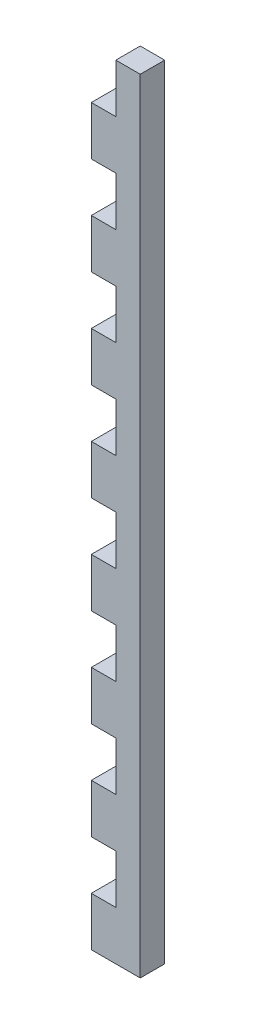
ISO-10303-21;
HEADER;
FILE_DESCRIPTION(('STEP AP214'),'2;1');
FILE_NAME('part.step','',(''),(''),'','','');
FILE_SCHEMA(('AUTOMOTIVE_DESIGN { 1 0 10303 214 1 1 1 1 }'));
ENDSEC;
DATA;
#1=APPLICATION_CONTEXT('core data for automotive mechanical design processes');
#2=APPLICATION_PROTOCOL_DEFINITION('international standard','automotive_design',2000,#1);
#3=PRODUCT_CONTEXT('',#1,'mechanical');
#4=PRODUCT('Part','Part','',(#3));
#5=PRODUCT_RELATED_PRODUCT_CATEGORY('part','',(#4));
#6=PRODUCT_DEFINITION_FORMATION('','',#4);
#7=PRODUCT_DEFINITION_CONTEXT('part definition',#1,'design');
#8=PRODUCT_DEFINITION('design','',#6,#7);
#9=PRODUCT_DEFINITION_SHAPE('','',#8);
#10=(LENGTH_UNIT() NAMED_UNIT(*) SI_UNIT(.MILLI.,.METRE.));
#11=(NAMED_UNIT(*) PLANE_ANGLE_UNIT() SI_UNIT($,.RADIAN.));
#12=(NAMED_UNIT(*) SI_UNIT($,.STERADIAN.) SOLID_ANGLE_UNIT());
#13=UNCERTAINTY_MEASURE_WITH_UNIT(LENGTH_MEASURE(1.E-05),#10,'distance_accuracy_value','');
#14=(GEOMETRIC_REPRESENTATION_CONTEXT(3) GLOBAL_UNCERTAINTY_ASSIGNED_CONTEXT((#13)) GLOBAL_UNIT_ASSIGNED_CONTEXT((#10,
#11,#12)) REPRESENTATION_CONTEXT('',''));
#15=CARTESIAN_POINT('',(0.,0.,0.));
#16=DIRECTION('',(0.,0.,1.));
#17=DIRECTION('',(1.,0.,0.));
#18=AXIS2_PLACEMENT_3D('',#15,#16,#17);
#19=CARTESIAN_POINT('',(0.,-76.8888888888889,5.));
#20=DIRECTION('',(0.,1.,0.));
#21=DIRECTION('',(0.,0.,1.));
#22=AXIS2_PLACEMENT_3D('',#19,#20,#21);
#23=PLANE('',#22);
#24=DIRECTION('',(1.,0.,0.));
#25=VECTOR('',#24,1.);
#26=CARTESIAN_POINT('',(0.,-76.8888888888889,0.));
#27=LINE('',#26,#25);
#28=CARTESIAN_POINT('',(-10.5031095495496,-76.8888888888889,0.));
#29=VERTEX_POINT('',#28);
#30=CARTESIAN_POINT('',(-5.50310954954811,-76.8888888888889,0.));
#31=VERTEX_POINT('',#30);
#32=EDGE_CURVE('E286',#29,#31,#27,.T.);
#33=ORIENTED_EDGE('',*,*,#32,.F.);
#34=DIRECTION('',(0.,0.,-1.));
#35=VECTOR('',#34,1.);
#36=CARTESIAN_POINT('',(-10.5031095495496,-76.8888888888889,5.));
#37=LINE('',#36,#35);
#38=CARTESIAN_POINT('',(-10.5031095495496,-76.8888888888889,5.));
#39=VERTEX_POINT('',#38);
#40=EDGE_CURVE('E11',#39,#29,#37,.T.);
#41=ORIENTED_EDGE('',*,*,#40,.F.);
#42=DIRECTION('',(1.,0.,0.));
#43=VECTOR('',#42,1.);
#44=CARTESIAN_POINT('',(0.,-76.8888888888889,5.));
#45=LINE('',#44,#43);
#46=CARTESIAN_POINT('',(-5.50310954954811,-76.8888888888889,5.));
#47=VERTEX_POINT('',#46);
#48=EDGE_CURVE('E363',#39,#47,#45,.T.);
#49=ORIENTED_EDGE('',*,*,#48,.T.);
#50=DIRECTION('',(0.,0.,-1.));
#51=VECTOR('',#50,1.);
#52=CARTESIAN_POINT('',(-5.50310954954811,-76.8888888888889,5.));
#53=LINE('',#52,#51);
#54=EDGE_CURVE('E164',#47,#31,#53,.T.);
#55=ORIENTED_EDGE('',*,*,#54,.T.);
#56=EDGE_LOOP('',(#33,#41,#49,#55));
#57=FACE_BOUND('',#56,.T.);
#58=ADVANCED_FACE('F35',(#57),#23,.T.);
#59=CARTESIAN_POINT('',(-10.5031095495496,0.,5.));
#60=DIRECTION('',(1.,0.,0.));
#61=DIRECTION('',(0.,1.,0.));
#62=AXIS2_PLACEMENT_3D('',#59,#60,#61);
#63=PLANE('',#62);
#64=DIRECTION('',(0.,-1.,0.));
#65=VECTOR('',#64,1.);
#66=CARTESIAN_POINT('',(-10.5031095495496,0.,0.));
#67=LINE('',#66,#65);
#68=CARTESIAN_POINT('',(-10.5031095495496,-86.8888888888889,0.));
#69=VERTEX_POINT('',#68);
#70=EDGE_CURVE('E289',#29,#69,#67,.T.);
#71=ORIENTED_EDGE('',*,*,#70,.T.);
#72=DIRECTION('',(0.,0.,-1.));
#73=VECTOR('',#72,1.);
#74=CARTESIAN_POINT('',(-10.5031095495496,-86.8888888888889,5.));
#75=LINE('',#74,#73);
#76=CARTESIAN_POINT('',(-10.5031095495496,-86.8888888888889,5.));
#77=VERTEX_POINT('',#76);
#78=EDGE_CURVE('E43',#77,#69,#75,.T.);
#79=ORIENTED_EDGE('',*,*,#78,.F.);
#80=DIRECTION('',(0.,-1.,0.));
#81=VECTOR('',#80,1.);
#82=CARTESIAN_POINT('',(-10.5031095495496,0.,5.));
#83=LINE('',#82,#81);
#84=EDGE_CURVE('E272',#39,#77,#83,.T.);
#85=ORIENTED_EDGE('',*,*,#84,.F.);
#86=ORIENTED_EDGE('',*,*,#40,.T.);
#87=EDGE_LOOP('',(#71,#79,#85,#86));
#88=FACE_BOUND('',#87,.T.);
#89=ADVANCED_FACE('F635',(#88),#63,.F.);
#90=CARTESIAN_POINT('',(0.,-86.8888888888889,5.));
#91=DIRECTION('',(0.,1.,0.));
#92=DIRECTION('',(0.,0.,1.));
#93=AXIS2_PLACEMENT_3D('',#90,#91,#92);
#94=PLANE('',#93);
#95=DIRECTION('',(1.,0.,0.));
#96=VECTOR('',#95,1.);
#97=CARTESIAN_POINT('',(0.,-86.8888888888889,0.));
#98=LINE('',#97,#96);
#99=CARTESIAN_POINT('',(-0.50310954954956,-86.8888888888889,0.));
#100=VERTEX_POINT('',#99);
#101=EDGE_CURVE('E291',#69,#100,#98,.T.);
#102=ORIENTED_EDGE('',*,*,#101,.T.);
#103=DIRECTION('',(0.,0.,-1.));
#104=VECTOR('',#103,1.);
#105=CARTESIAN_POINT('',(-0.50310954954956,-86.8888888888889,5.));
#106=LINE('',#105,#104);
#107=CARTESIAN_POINT('',(-0.50310954954956,-86.8888888888889,5.));
#108=VERTEX_POINT('',#107);
#109=EDGE_CURVE('E433',#108,#100,#106,.T.);
#110=ORIENTED_EDGE('',*,*,#109,.F.);
#111=DIRECTION('',(1.,0.,0.));
#112=VECTOR('',#111,1.);
#113=CARTESIAN_POINT('',(0.,-86.8888888888889,5.));
#114=LINE('',#113,#112);
#115=EDGE_CURVE('E441',#77,#108,#114,.T.);
#116=ORIENTED_EDGE('',*,*,#115,.F.);
#117=ORIENTED_EDGE('',*,*,#78,.T.);
#118=EDGE_LOOP('',(#102,#110,#116,#117));
#119=FACE_BOUND('',#118,.T.);
#120=ADVANCED_FACE('F439',(#119),#94,.F.);
#121=CARTESIAN_POINT('',(-0.50310954954957,0.,5.));
#122=DIRECTION('',(1.,0.,0.));
#123=DIRECTION('',(0.,1.,0.));
#124=AXIS2_PLACEMENT_3D('',#121,#122,#123);
#125=PLANE('',#124);
#126=DIRECTION('',(0.,-1.,0.));
#127=VECTOR('',#126,1.);
#128=CARTESIAN_POINT('',(-0.50310954954957,0.,0.));
#129=LINE('',#128,#127);
#130=CARTESIAN_POINT('',(-0.503109549549579,73.1111111111111,0.));
#131=VERTEX_POINT('',#130);
#132=EDGE_CURVE('E295',#131,#100,#129,.T.);
#133=ORIENTED_EDGE('',*,*,#132,.F.);
#134=DIRECTION('',(0.,0.,-1.));
#135=VECTOR('',#134,1.);
#136=CARTESIAN_POINT('',(-0.503109549549579,73.1111111111111,5.));
#137=LINE('',#136,#135);
#138=CARTESIAN_POINT('',(-0.503109549549579,73.1111111111111,5.));
#139=VERTEX_POINT('',#138);
#140=EDGE_CURVE('E431',#139,#131,#137,.T.);
#141=ORIENTED_EDGE('',*,*,#140,.F.);
#142=DIRECTION('',(0.,-1.,0.));
#143=VECTOR('',#142,1.);
#144=CARTESIAN_POINT('',(-0.50310954954957,0.,5.));
#145=LINE('',#144,#143);
#146=EDGE_CURVE('E453',#139,#108,#145,.T.);
#147=ORIENTED_EDGE('',*,*,#146,.T.);
#148=ORIENTED_EDGE('',*,*,#109,.T.);
#149=EDGE_LOOP('',(#133,#141,#147,#148));
#150=FACE_BOUND('',#149,.T.);
#151=ADVANCED_FACE('F450',(#150),#125,.T.);
#152=CARTESIAN_POINT('',(0.,73.1111111111111,5.));
#153=DIRECTION('',(0.,1.,0.));
#154=DIRECTION('',(0.,0.,1.));
#155=AXIS2_PLACEMENT_3D('',#152,#153,#154);
#156=PLANE('',#155);
#157=DIRECTION('',(1.,0.,0.));
#158=VECTOR('',#157,1.);
#159=CARTESIAN_POINT('',(0.,73.1111111111111,0.));
#160=LINE('',#159,#158);
#161=CARTESIAN_POINT('',(-5.50310954954958,73.1111111111111,0.));
#162=VERTEX_POINT('',#161);
#163=EDGE_CURVE('E298',#162,#131,#160,.T.);
#164=ORIENTED_EDGE('',*,*,#163,.F.);
#165=DIRECTION('',(0.,0.,-1.));
#166=VECTOR('',#165,1.);
#167=CARTESIAN_POINT('',(-5.50310954954958,73.1111111111111,5.));
#168=LINE('',#167,#166);
#169=CARTESIAN_POINT('',(-5.50310954954958,73.1111111111111,5.));
#170=VERTEX_POINT('',#169);
#171=EDGE_CURVE('E429',#170,#162,#168,.T.);
#172=ORIENTED_EDGE('',*,*,#171,.F.);
#173=DIRECTION('',(1.,0.,0.));
#174=VECTOR('',#173,1.);
#175=CARTESIAN_POINT('',(0.,73.1111111111111,5.));
#176=LINE('',#175,#174);
#177=EDGE_CURVE('E456',#170,#139,#176,.T.);
#178=ORIENTED_EDGE('',*,*,#177,.T.);
#179=ORIENTED_EDGE('',*,*,#140,.T.);
#180=EDGE_LOOP('',(#164,#172,#178,#179));
#181=FACE_BOUND('',#180,.T.);
#182=ADVANCED_FACE('F871',(#181),#156,.T.);
#183=CARTESIAN_POINT('',(-5.50310954954957,0.,5.));
#184=DIRECTION('',(1.,0.,0.));
#185=DIRECTION('',(0.,1.,0.));
#186=AXIS2_PLACEMENT_3D('',#183,#184,#185);
#187=PLANE('',#186);
#188=DIRECTION('',(0.,-1.,0.));
#189=VECTOR('',#188,1.);
#190=CARTESIAN_POINT('',(-5.50310954954957,0.,0.));
#191=LINE('',#190,#189);
#192=CARTESIAN_POINT('',(-5.50310954954958,63.1111111111111,0.));
#193=VERTEX_POINT('',#192);
#194=EDGE_CURVE('E301',#162,#193,#191,.T.);
#195=ORIENTED_EDGE('',*,*,#194,.T.);
#196=DIRECTION('',(0.,0.,-1.));
#197=VECTOR('',#196,1.);
#198=CARTESIAN_POINT('',(-5.50310954954958,63.1111111111111,5.));
#199=LINE('',#198,#197);
#200=CARTESIAN_POINT('',(-5.50310954954958,63.1111111111111,5.));
#201=VERTEX_POINT('',#200);
#202=EDGE_CURVE('E427',#201,#193,#199,.T.);
#203=ORIENTED_EDGE('',*,*,#202,.F.);
#204=DIRECTION('',(0.,-1.,0.));
#205=VECTOR('',#204,1.);
#206=CARTESIAN_POINT('',(-5.50310954954957,0.,5.));
#207=LINE('',#206,#205);
#208=EDGE_CURVE('E458',#170,#201,#207,.T.);
#209=ORIENTED_EDGE('',*,*,#208,.F.);
#210=ORIENTED_EDGE('',*,*,#171,.T.);
#211=EDGE_LOOP('',(#195,#203,#209,#210));
#212=FACE_BOUND('',#211,.T.);
#213=ADVANCED_FACE('F862',(#212),#187,.F.);
#214=CARTESIAN_POINT('',(0.,63.1111111111111,5.));
#215=DIRECTION('',(0.,1.,0.));
#216=DIRECTION('',(0.,0.,1.));
#217=AXIS2_PLACEMENT_3D('',#214,#215,#216);
#218=PLANE('',#217);
#219=DIRECTION('',(1.,0.,0.));
#220=VECTOR('',#219,1.);
#221=CARTESIAN_POINT('',(0.,63.1111111111111,0.));
#222=LINE('',#221,#220);
#223=CARTESIAN_POINT('',(-10.5031095495496,63.1111111111111,0.));
#224=VERTEX_POINT('',#223);
#225=EDGE_CURVE('E304',#224,#193,#222,.T.);
#226=ORIENTED_EDGE('',*,*,#225,.F.);
#227=DIRECTION('',(0.,0.,-1.));
#228=VECTOR('',#227,1.);
#229=CARTESIAN_POINT('',(-10.5031095495496,63.1111111111111,5.));
#230=LINE('',#229,#228);
#231=CARTESIAN_POINT('',(-10.5031095495496,63.1111111111111,5.));
#232=VERTEX_POINT('',#231);
#233=EDGE_CURVE('E425',#232,#224,#230,.T.);
#234=ORIENTED_EDGE('',*,*,#233,.F.);
#235=DIRECTION('',(1.,0.,0.));
#236=VECTOR('',#235,1.);
#237=CARTESIAN_POINT('',(0.,63.1111111111111,5.));
#238=LINE('',#237,#236);
#239=EDGE_CURVE('E463',#232,#201,#238,.T.);
#240=ORIENTED_EDGE('',*,*,#239,.T.);
#241=ORIENTED_EDGE('',*,*,#202,.T.);
#242=EDGE_LOOP('',(#226,#234,#240,#241));
#243=FACE_BOUND('',#242,.T.);
#244=ADVANCED_FACE('F855',(#243),#218,.T.);
#245=CARTESIAN_POINT('',(-10.5031095495494,53.1111111111111,0.));
#246=VERTEX_POINT('',#245);
#247=EDGE_CURVE('E292',#224,#246,#67,.T.);
#248=ORIENTED_EDGE('',*,*,#247,.T.);
#249=DIRECTION('',(0.,0.,-1.));
#250=VECTOR('',#249,1.);
#251=CARTESIAN_POINT('',(-10.5031095495494,53.1111111111111,5.));
#252=LINE('',#251,#250);
#253=CARTESIAN_POINT('',(-10.5031095495494,53.1111111111111,5.));
#254=VERTEX_POINT('',#253);
#255=EDGE_CURVE('E422',#254,#246,#252,.T.);
#256=ORIENTED_EDGE('',*,*,#255,.F.);
#257=EDGE_CURVE('E466',#232,#254,#83,.T.);
#258=ORIENTED_EDGE('',*,*,#257,.F.);
#259=ORIENTED_EDGE('',*,*,#233,.T.);
#260=EDGE_LOOP('',(#248,#256,#258,#259));
#261=FACE_BOUND('',#260,.T.);
#262=ADVANCED_FACE('F533',(#261),#63,.F.);
#263=CARTESIAN_POINT('',(0.,53.1111111111111,5.));
#264=DIRECTION('',(0.,1.,0.));
#265=DIRECTION('',(0.,0.,1.));
#266=AXIS2_PLACEMENT_3D('',#263,#264,#265);
#267=PLANE('',#266);
#268=DIRECTION('',(1.,0.,0.));
#269=VECTOR('',#268,1.);
#270=CARTESIAN_POINT('',(0.,53.1111111111111,0.));
#271=LINE('',#270,#269);
#272=CARTESIAN_POINT('',(-5.50310954954937,53.1111111111111,0.));
#273=VERTEX_POINT('',#272);
#274=EDGE_CURVE('E307',#246,#273,#271,.T.);
#275=ORIENTED_EDGE('',*,*,#274,.T.);
#276=DIRECTION('',(0.,0.,-1.));
#277=VECTOR('',#276,1.);
#278=CARTESIAN_POINT('',(-5.50310954954937,53.1111111111111,5.));
#279=LINE('',#278,#277);
#280=CARTESIAN_POINT('',(-5.50310954954937,53.1111111111111,5.));
#281=VERTEX_POINT('',#280);
#282=EDGE_CURVE('E419',#281,#273,#279,.T.);
#283=ORIENTED_EDGE('',*,*,#282,.F.);
#284=DIRECTION('',(1.,0.,0.));
#285=VECTOR('',#284,1.);
#286=CARTESIAN_POINT('',(0.,53.1111111111111,5.));
#287=LINE('',#286,#285);
#288=EDGE_CURVE('E467',#254,#281,#287,.T.);
#289=ORIENTED_EDGE('',*,*,#288,.F.);
#290=ORIENTED_EDGE('',*,*,#255,.T.);
#291=EDGE_LOOP('',(#275,#283,#289,#290));
#292=FACE_BOUND('',#291,.T.);
#293=ADVANCED_FACE('F539',(#292),#267,.F.);
#294=CARTESIAN_POINT('',(-5.50310954954936,0.,5.));
#295=DIRECTION('',(1.,0.,0.));
#296=DIRECTION('',(0.,1.,0.));
#297=AXIS2_PLACEMENT_3D('',#294,#295,#296);
#298=PLANE('',#297);
#299=DIRECTION('',(0.,-1.,0.));
#300=VECTOR('',#299,1.);
#301=CARTESIAN_POINT('',(-5.50310954954936,0.,0.));
#302=LINE('',#301,#300);
#303=CARTESIAN_POINT('',(-5.50310954954937,43.1111111111111,0.));
#304=VERTEX_POINT('',#303);
#305=EDGE_CURVE('E309',#273,#304,#302,.T.);
#306=ORIENTED_EDGE('',*,*,#305,.T.);
#307=DIRECTION('',(0.,0.,-1.));
#308=VECTOR('',#307,1.);
#309=CARTESIAN_POINT('',(-5.50310954954937,43.1111111111111,5.));
#310=LINE('',#309,#308);
#311=CARTESIAN_POINT('',(-5.50310954954937,43.1111111111111,5.));
#312=VERTEX_POINT('',#311);
#313=EDGE_CURVE('E417',#312,#304,#310,.T.);
#314=ORIENTED_EDGE('',*,*,#313,.F.);
#315=DIRECTION('',(0.,-1.,0.));
#316=VECTOR('',#315,1.);
#317=CARTESIAN_POINT('',(-5.50310954954936,0.,5.));
#318=LINE('',#317,#316);
#319=EDGE_CURVE('E469',#281,#312,#318,.T.);
#320=ORIENTED_EDGE('',*,*,#319,.F.);
#321=ORIENTED_EDGE('',*,*,#282,.T.);
#322=EDGE_LOOP('',(#306,#314,#320,#321));
#323=FACE_BOUND('',#322,.T.);
#324=ADVANCED_FACE('F545',(#323),#298,.F.);
#325=CARTESIAN_POINT('',(0.,43.1111111111111,5.));
#326=DIRECTION('',(0.,1.,0.));
#327=DIRECTION('',(0.,0.,1.));
#328=AXIS2_PLACEMENT_3D('',#325,#326,#327);
#329=PLANE('',#328);
#330=DIRECTION('',(1.,0.,0.));
#331=VECTOR('',#330,1.);
#332=CARTESIAN_POINT('',(0.,43.1111111111111,0.));
#333=LINE('',#332,#331);
#334=CARTESIAN_POINT('',(-10.5031095495494,43.1111111111111,0.));
#335=VERTEX_POINT('',#334);
#336=EDGE_CURVE('E312',#335,#304,#333,.T.);
#337=ORIENTED_EDGE('',*,*,#336,.F.);
#338=DIRECTION('',(0.,0.,-1.));
#339=VECTOR('',#338,1.);
#340=CARTESIAN_POINT('',(-10.5031095495494,43.1111111111111,5.));
#341=LINE('',#340,#339);
#342=CARTESIAN_POINT('',(-10.5031095495494,43.1111111111111,5.));
#343=VERTEX_POINT('',#342);
#344=EDGE_CURVE('E415',#343,#335,#341,.T.);
#345=ORIENTED_EDGE('',*,*,#344,.F.);
#346=DIRECTION('',(1.,0.,0.));
#347=VECTOR('',#346,1.);
#348=CARTESIAN_POINT('',(0.,43.1111111111111,5.));
#349=LINE('',#348,#347);
#350=EDGE_CURVE('E471',#343,#312,#349,.T.);
#351=ORIENTED_EDGE('',*,*,#350,.T.);
#352=ORIENTED_EDGE('',*,*,#313,.T.);
#353=EDGE_LOOP('',(#337,#345,#351,#352));
#354=FACE_BOUND('',#353,.T.);
#355=ADVANCED_FACE('F624',(#354),#329,.T.);
#356=CARTESIAN_POINT('',(-10.5031095495496,33.1111111111111,0.));
#357=VERTEX_POINT('',#356);
#358=EDGE_CURVE('E315',#335,#357,#67,.T.);
#359=ORIENTED_EDGE('',*,*,#358,.T.);
#360=DIRECTION('',(0.,0.,-1.));
#361=VECTOR('',#360,1.);
#362=CARTESIAN_POINT('',(-10.5031095495496,33.1111111111111,5.));
#363=LINE('',#362,#361);
#364=CARTESIAN_POINT('',(-10.5031095495496,33.1111111111111,5.));
#365=VERTEX_POINT('',#364);
#366=EDGE_CURVE('E412',#365,#357,#363,.T.);
#367=ORIENTED_EDGE('',*,*,#366,.F.);
#368=EDGE_CURVE('E474',#343,#365,#83,.T.);
#369=ORIENTED_EDGE('',*,*,#368,.F.);
#370=ORIENTED_EDGE('',*,*,#344,.T.);
#371=EDGE_LOOP('',(#359,#367,#369,#370));
#372=FACE_BOUND('',#371,.T.);
#373=ADVANCED_FACE('F622',(#372),#63,.F.);
#374=CARTESIAN_POINT('',(0.,33.1111111111111,5.));
#375=DIRECTION('',(0.,1.,0.));
#376=DIRECTION('',(0.,0.,1.));
#377=AXIS2_PLACEMENT_3D('',#374,#375,#376);
#378=PLANE('',#377);
#379=DIRECTION('',(1.,0.,0.));
#380=VECTOR('',#379,1.);
#381=CARTESIAN_POINT('',(0.,33.1111111111111,0.));
#382=LINE('',#381,#380);
#383=CARTESIAN_POINT('',(-5.50310954954916,33.1111111111111,0.));
#384=VERTEX_POINT('',#383);
#385=EDGE_CURVE('E316',#357,#384,#382,.T.);
#386=ORIENTED_EDGE('',*,*,#385,.T.);
#387=DIRECTION('',(0.,0.,-1.));
#388=VECTOR('',#387,1.);
#389=CARTESIAN_POINT('',(-5.50310954954916,33.1111111111111,5.));
#390=LINE('',#389,#388);
#391=CARTESIAN_POINT('',(-5.50310954954916,33.1111111111111,5.));
#392=VERTEX_POINT('',#391);
#393=EDGE_CURVE('E409',#392,#384,#390,.T.);
#394=ORIENTED_EDGE('',*,*,#393,.F.);
#395=DIRECTION('',(1.,0.,0.));
#396=VECTOR('',#395,1.);
#397=CARTESIAN_POINT('',(0.,33.1111111111111,5.));
#398=LINE('',#397,#396);
#399=EDGE_CURVE('E475',#365,#392,#398,.T.);
#400=ORIENTED_EDGE('',*,*,#399,.F.);
#401=ORIENTED_EDGE('',*,*,#366,.T.);
#402=EDGE_LOOP('',(#386,#394,#400,#401));
#403=FACE_BOUND('',#402,.T.);
#404=ADVANCED_FACE('F621',(#403),#378,.F.);
#405=CARTESIAN_POINT('',(-5.50310954954916,0.,5.));
#406=DIRECTION('',(1.,0.,0.));
#407=DIRECTION('',(0.,1.,0.));
#408=AXIS2_PLACEMENT_3D('',#405,#406,#407);
#409=PLANE('',#408);
#410=DIRECTION('',(0.,-1.,0.));
#411=VECTOR('',#410,1.);
#412=CARTESIAN_POINT('',(-5.50310954954916,0.,0.));
#413=LINE('',#412,#411);
#414=CARTESIAN_POINT('',(-5.50310954954916,23.1111111111111,0.));
#415=VERTEX_POINT('',#414);
#416=EDGE_CURVE('E318',#384,#415,#413,.T.);
#417=ORIENTED_EDGE('',*,*,#416,.T.);
#418=DIRECTION('',(0.,0.,-1.));
#419=VECTOR('',#418,1.);
#420=CARTESIAN_POINT('',(-5.50310954954916,23.1111111111111,5.));
#421=LINE('',#420,#419);
#422=CARTESIAN_POINT('',(-5.50310954954916,23.1111111111111,5.));
#423=VERTEX_POINT('',#422);
#424=EDGE_CURVE('E407',#423,#415,#421,.T.);
#425=ORIENTED_EDGE('',*,*,#424,.F.);
#426=DIRECTION('',(0.,-1.,0.));
#427=VECTOR('',#426,1.);
#428=CARTESIAN_POINT('',(-5.50310954954916,0.,5.));
#429=LINE('',#428,#427);
#430=EDGE_CURVE('E477',#392,#423,#429,.T.);
#431=ORIENTED_EDGE('',*,*,#430,.F.);
#432=ORIENTED_EDGE('',*,*,#393,.T.);
#433=EDGE_LOOP('',(#417,#425,#431,#432));
#434=FACE_BOUND('',#433,.T.);
#435=ADVANCED_FACE('F617',(#434),#409,.F.);
#436=CARTESIAN_POINT('',(0.,23.1111111111111,5.));
#437=DIRECTION('',(0.,1.,0.));
#438=DIRECTION('',(0.,0.,1.));
#439=AXIS2_PLACEMENT_3D('',#436,#437,#438);
#440=PLANE('',#439);
#441=DIRECTION('',(1.,0.,0.));
#442=VECTOR('',#441,1.);
#443=CARTESIAN_POINT('',(0.,23.1111111111111,0.));
#444=LINE('',#443,#442);
#445=CARTESIAN_POINT('',(-10.5031095495496,23.1111111111111,0.));
#446=VERTEX_POINT('',#445);
#447=EDGE_CURVE('E321',#446,#415,#444,.T.);
#448=ORIENTED_EDGE('',*,*,#447,.F.);
#449=DIRECTION('',(0.,0.,-1.));
#450=VECTOR('',#449,1.);
#451=CARTESIAN_POINT('',(-10.5031095495496,23.1111111111111,5.));
#452=LINE('',#451,#450);
#453=CARTESIAN_POINT('',(-10.5031095495496,23.1111111111111,5.));
#454=VERTEX_POINT('',#453);
#455=EDGE_CURVE('E405',#454,#446,#452,.T.);
#456=ORIENTED_EDGE('',*,*,#455,.F.);
#457=DIRECTION('',(1.,0.,0.));
#458=VECTOR('',#457,1.);
#459=CARTESIAN_POINT('',(0.,23.1111111111111,5.));
#460=LINE('',#459,#458);
#461=EDGE_CURVE('E479',#454,#423,#460,.T.);
#462=ORIENTED_EDGE('',*,*,#461,.T.);
#463=ORIENTED_EDGE('',*,*,#424,.T.);
#464=EDGE_LOOP('',(#448,#456,#462,#463));
#465=FACE_BOUND('',#464,.T.);
#466=ADVANCED_FACE('F613',(#465),#440,.T.);
#467=CARTESIAN_POINT('',(-10.5031095495496,13.1111111111111,0.));
#468=VERTEX_POINT('',#467);
#469=EDGE_CURVE('E324',#446,#468,#67,.T.);
#470=ORIENTED_EDGE('',*,*,#469,.T.);
#471=DIRECTION('',(0.,0.,-1.));
#472=VECTOR('',#471,1.);
#473=CARTESIAN_POINT('',(-10.5031095495496,13.1111111111111,5.));
#474=LINE('',#473,#472);
#475=CARTESIAN_POINT('',(-10.5031095495496,13.1111111111111,5.));
#476=VERTEX_POINT('',#475);
#477=EDGE_CURVE('E402',#476,#468,#474,.T.);
#478=ORIENTED_EDGE('',*,*,#477,.F.);
#479=EDGE_CURVE('E482',#454,#476,#83,.T.);
#480=ORIENTED_EDGE('',*,*,#479,.F.);
#481=ORIENTED_EDGE('',*,*,#455,.T.);
#482=EDGE_LOOP('',(#470,#478,#480,#481));
#483=FACE_BOUND('',#482,.T.);
#484=ADVANCED_FACE('F608',(#483),#63,.F.);
#485=CARTESIAN_POINT('',(0.,13.1111111111111,5.));
#486=DIRECTION('',(0.,1.,0.));
#487=DIRECTION('',(0.,0.,1.));
#488=AXIS2_PLACEMENT_3D('',#485,#486,#487);
#489=PLANE('',#488);
#490=DIRECTION('',(1.,0.,0.));
#491=VECTOR('',#490,1.);
#492=CARTESIAN_POINT('',(0.,13.1111111111111,0.));
#493=LINE('',#492,#491);
#494=CARTESIAN_POINT('',(-5.50310954954895,13.1111111111111,0.));
#495=VERTEX_POINT('',#494);
#496=EDGE_CURVE('E325',#468,#495,#493,.T.);
#497=ORIENTED_EDGE('',*,*,#496,.T.);
#498=DIRECTION('',(0.,0.,-1.));
#499=VECTOR('',#498,1.);
#500=CARTESIAN_POINT('',(-5.50310954954895,13.1111111111111,5.));
#501=LINE('',#500,#499);
#502=CARTESIAN_POINT('',(-5.50310954954895,13.1111111111111,5.));
#503=VERTEX_POINT('',#502);
#504=EDGE_CURVE('E399',#503,#495,#501,.T.);
#505=ORIENTED_EDGE('',*,*,#504,.F.);
#506=DIRECTION('',(1.,0.,0.));
#507=VECTOR('',#506,1.);
#508=CARTESIAN_POINT('',(0.,13.1111111111111,5.));
#509=LINE('',#508,#507);
#510=EDGE_CURVE('E483',#476,#503,#509,.T.);
#511=ORIENTED_EDGE('',*,*,#510,.F.);
#512=ORIENTED_EDGE('',*,*,#477,.T.);
#513=EDGE_LOOP('',(#497,#505,#511,#512));
#514=FACE_BOUND('',#513,.T.);
#515=ADVANCED_FACE('F607',(#514),#489,.F.);
#516=CARTESIAN_POINT('',(-5.50310954954895,0.,5.));
#517=DIRECTION('',(1.,0.,0.));
#518=DIRECTION('',(0.,1.,0.));
#519=AXIS2_PLACEMENT_3D('',#516,#517,#518);
#520=PLANE('',#519);
#521=DIRECTION('',(0.,-1.,0.));
#522=VECTOR('',#521,1.);
#523=CARTESIAN_POINT('',(-5.50310954954895,0.,0.));
#524=LINE('',#523,#522);
#525=CARTESIAN_POINT('',(-5.50310954954895,3.11111111111112,0.));
#526=VERTEX_POINT('',#525);
#527=EDGE_CURVE('E327',#495,#526,#524,.T.);
#528=ORIENTED_EDGE('',*,*,#527,.T.);
#529=DIRECTION('',(0.,0.,-1.));
#530=VECTOR('',#529,1.);
#531=CARTESIAN_POINT('',(-5.50310954954895,3.11111111111112,5.));
#532=LINE('',#531,#530);
#533=CARTESIAN_POINT('',(-5.50310954954895,3.11111111111112,5.));
#534=VERTEX_POINT('',#533);
#535=EDGE_CURVE('E397',#534,#526,#532,.T.);
#536=ORIENTED_EDGE('',*,*,#535,.F.);
#537=DIRECTION('',(0.,-1.,0.));
#538=VECTOR('',#537,1.);
#539=CARTESIAN_POINT('',(-5.50310954954895,0.,5.));
#540=LINE('',#539,#538);
#541=EDGE_CURVE('E485',#503,#534,#540,.T.);
#542=ORIENTED_EDGE('',*,*,#541,.F.);
#543=ORIENTED_EDGE('',*,*,#504,.T.);
#544=EDGE_LOOP('',(#528,#536,#542,#543));
#545=FACE_BOUND('',#544,.T.);
#546=ADVANCED_FACE('F603',(#545),#520,.F.);
#547=CARTESIAN_POINT('',(0.,3.11111111111112,5.));
#548=DIRECTION('',(0.,1.,0.));
#549=DIRECTION('',(0.,0.,1.));
#550=AXIS2_PLACEMENT_3D('',#547,#548,#549);
#551=PLANE('',#550);
#552=DIRECTION('',(1.,0.,0.));
#553=VECTOR('',#552,1.);
#554=CARTESIAN_POINT('',(0.,3.11111111111112,0.));
#555=LINE('',#554,#553);
#556=CARTESIAN_POINT('',(-10.5031095495496,3.11111111111112,0.));
#557=VERTEX_POINT('',#556);
#558=EDGE_CURVE('E330',#557,#526,#555,.T.);
#559=ORIENTED_EDGE('',*,*,#558,.F.);
#560=DIRECTION('',(0.,0.,-1.));
#561=VECTOR('',#560,1.);
#562=CARTESIAN_POINT('',(-10.5031095495496,3.11111111111112,5.));
#563=LINE('',#562,#561);
#564=CARTESIAN_POINT('',(-10.5031095495496,3.11111111111112,5.));
#565=VERTEX_POINT('',#564);
#566=EDGE_CURVE('E395',#565,#557,#563,.T.);
#567=ORIENTED_EDGE('',*,*,#566,.F.);
#568=DIRECTION('',(1.,0.,0.));
#569=VECTOR('',#568,1.);
#570=CARTESIAN_POINT('',(0.,3.11111111111112,5.));
#571=LINE('',#570,#569);
#572=EDGE_CURVE('E487',#565,#534,#571,.T.);
#573=ORIENTED_EDGE('',*,*,#572,.T.);
#574=ORIENTED_EDGE('',*,*,#535,.T.);
#575=EDGE_LOOP('',(#559,#567,#573,#574));
#576=FACE_BOUND('',#575,.T.);
#577=ADVANCED_FACE('F599',(#576),#551,.T.);
#578=CARTESIAN_POINT('',(-10.5031095495496,-6.88888888888889,0.));
#579=VERTEX_POINT('',#578);
#580=EDGE_CURVE('E333',#557,#579,#67,.T.);
#581=ORIENTED_EDGE('',*,*,#580,.T.);
#582=DIRECTION('',(0.,0.,-1.));
#583=VECTOR('',#582,1.);
#584=CARTESIAN_POINT('',(-10.5031095495496,-6.88888888888889,5.));
#585=LINE('',#584,#583);
#586=CARTESIAN_POINT('',(-10.5031095495496,-6.88888888888889,5.));
#587=VERTEX_POINT('',#586);
#588=EDGE_CURVE('E392',#587,#579,#585,.T.);
#589=ORIENTED_EDGE('',*,*,#588,.F.);
#590=EDGE_CURVE('E490',#565,#587,#83,.T.);
#591=ORIENTED_EDGE('',*,*,#590,.F.);
#592=ORIENTED_EDGE('',*,*,#566,.T.);
#593=EDGE_LOOP('',(#581,#589,#591,#592));
#594=FACE_BOUND('',#593,.T.);
#595=ADVANCED_FACE('F594',(#594),#63,.F.);
#596=CARTESIAN_POINT('',(0.,-6.88888888888889,5.));
#597=DIRECTION('',(0.,1.,0.));
#598=DIRECTION('',(0.,0.,1.));
#599=AXIS2_PLACEMENT_3D('',#596,#597,#598);
#600=PLANE('',#599);
#601=DIRECTION('',(1.,0.,0.));
#602=VECTOR('',#601,1.);
#603=CARTESIAN_POINT('',(0.,-6.88888888888889,0.));
#604=LINE('',#603,#602);
#605=CARTESIAN_POINT('',(-5.50310954954874,-6.88888888888889,0.));
#606=VERTEX_POINT('',#605);
#607=EDGE_CURVE('E334',#579,#606,#604,.T.);
#608=ORIENTED_EDGE('',*,*,#607,.T.);
#609=DIRECTION('',(0.,0.,-1.));
#610=VECTOR('',#609,1.);
#611=CARTESIAN_POINT('',(-5.50310954954874,-6.88888888888889,5.));
#612=LINE('',#611,#610);
#613=CARTESIAN_POINT('',(-5.50310954954874,-6.88888888888889,5.));
#614=VERTEX_POINT('',#613);
#615=EDGE_CURVE('E389',#614,#606,#612,.T.);
#616=ORIENTED_EDGE('',*,*,#615,.F.);
#617=DIRECTION('',(1.,0.,0.));
#618=VECTOR('',#617,1.);
#619=CARTESIAN_POINT('',(0.,-6.88888888888889,5.));
#620=LINE('',#619,#618);
#621=EDGE_CURVE('E491',#587,#614,#620,.T.);
#622=ORIENTED_EDGE('',*,*,#621,.F.);
#623=ORIENTED_EDGE('',*,*,#588,.T.);
#624=EDGE_LOOP('',(#608,#616,#622,#623));
#625=FACE_BOUND('',#624,.T.);
#626=ADVANCED_FACE('F593',(#625),#600,.F.);
#627=CARTESIAN_POINT('',(-5.50310954954874,0.,5.));
#628=DIRECTION('',(1.,0.,0.));
#629=DIRECTION('',(0.,1.,0.));
#630=AXIS2_PLACEMENT_3D('',#627,#628,#629);
#631=PLANE('',#630);
#632=DIRECTION('',(0.,-1.,0.));
#633=VECTOR('',#632,1.);
#634=CARTESIAN_POINT('',(-5.50310954954874,0.,0.));
#635=LINE('',#634,#633);
#636=CARTESIAN_POINT('',(-5.50310954954874,-16.8888888888889,0.));
#637=VERTEX_POINT('',#636);
#638=EDGE_CURVE('E336',#606,#637,#635,.T.);
#639=ORIENTED_EDGE('',*,*,#638,.T.);
#640=DIRECTION('',(0.,0.,-1.));
#641=VECTOR('',#640,1.);
#642=CARTESIAN_POINT('',(-5.50310954954874,-16.8888888888889,5.));
#643=LINE('',#642,#641);
#644=CARTESIAN_POINT('',(-5.50310954954874,-16.8888888888889,5.));
#645=VERTEX_POINT('',#644);
#646=EDGE_CURVE('E387',#645,#637,#643,.T.);
#647=ORIENTED_EDGE('',*,*,#646,.F.);
#648=DIRECTION('',(0.,-1.,0.));
#649=VECTOR('',#648,1.);
#650=CARTESIAN_POINT('',(-5.50310954954874,0.,5.));
#651=LINE('',#650,#649);
#652=EDGE_CURVE('E493',#614,#645,#651,.T.);
#653=ORIENTED_EDGE('',*,*,#652,.F.);
#654=ORIENTED_EDGE('',*,*,#615,.T.);
#655=EDGE_LOOP('',(#639,#647,#653,#654));
#656=FACE_BOUND('',#655,.T.);
#657=ADVANCED_FACE('F589',(#656),#631,.F.);
#658=CARTESIAN_POINT('',(0.,-16.8888888888889,5.));
#659=DIRECTION('',(0.,1.,0.));
#660=DIRECTION('',(0.,0.,1.));
#661=AXIS2_PLACEMENT_3D('',#658,#659,#660);
#662=PLANE('',#661);
#663=DIRECTION('',(1.,0.,0.));
#664=VECTOR('',#663,1.);
#665=CARTESIAN_POINT('',(0.,-16.8888888888889,0.));
#666=LINE('',#665,#664);
#667=CARTESIAN_POINT('',(-10.5031095495496,-16.8888888888889,0.));
#668=VERTEX_POINT('',#667);
#669=EDGE_CURVE('E339',#668,#637,#666,.T.);
#670=ORIENTED_EDGE('',*,*,#669,.F.);
#671=DIRECTION('',(0.,0.,-1.));
#672=VECTOR('',#671,1.);
#673=CARTESIAN_POINT('',(-10.5031095495496,-16.8888888888889,5.));
#674=LINE('',#673,#672);
#675=CARTESIAN_POINT('',(-10.5031095495496,-16.8888888888889,5.));
#676=VERTEX_POINT('',#675);
#677=EDGE_CURVE('E385',#676,#668,#674,.T.);
#678=ORIENTED_EDGE('',*,*,#677,.F.);
#679=DIRECTION('',(1.,0.,0.));
#680=VECTOR('',#679,1.);
#681=CARTESIAN_POINT('',(0.,-16.8888888888889,5.));
#682=LINE('',#681,#680);
#683=EDGE_CURVE('E495',#676,#645,#682,.T.);
#684=ORIENTED_EDGE('',*,*,#683,.T.);
#685=ORIENTED_EDGE('',*,*,#646,.T.);
#686=EDGE_LOOP('',(#670,#678,#684,#685));
#687=FACE_BOUND('',#686,.T.);
#688=ADVANCED_FACE('F585',(#687),#662,.T.);
#689=CARTESIAN_POINT('',(-10.5031095495496,-26.8888888888889,0.));
#690=VERTEX_POINT('',#689);
#691=EDGE_CURVE('E342',#668,#690,#67,.T.);
#692=ORIENTED_EDGE('',*,*,#691,.T.);
#693=DIRECTION('',(0.,0.,-1.));
#694=VECTOR('',#693,1.);
#695=CARTESIAN_POINT('',(-10.5031095495496,-26.8888888888889,5.));
#696=LINE('',#695,#694);
#697=CARTESIAN_POINT('',(-10.5031095495496,-26.8888888888889,5.));
#698=VERTEX_POINT('',#697);
#699=EDGE_CURVE('E382',#698,#690,#696,.T.);
#700=ORIENTED_EDGE('',*,*,#699,.F.);
#701=EDGE_CURVE('E498',#676,#698,#83,.T.);
#702=ORIENTED_EDGE('',*,*,#701,.F.);
#703=ORIENTED_EDGE('',*,*,#677,.T.);
#704=EDGE_LOOP('',(#692,#700,#702,#703));
#705=FACE_BOUND('',#704,.T.);
#706=ADVANCED_FACE('F581',(#705),#63,.F.);
#707=CARTESIAN_POINT('',(0.,-26.8888888888889,5.));
#708=DIRECTION('',(0.,1.,0.));
#709=DIRECTION('',(0.,0.,1.));
#710=AXIS2_PLACEMENT_3D('',#707,#708,#709);
#711=PLANE('',#710);
#712=DIRECTION('',(1.,0.,0.));
#713=VECTOR('',#712,1.);
#714=CARTESIAN_POINT('',(0.,-26.8888888888889,0.));
#715=LINE('',#714,#713);
#716=CARTESIAN_POINT('',(-5.50310954954853,-26.8888888888889,0.));
#717=VERTEX_POINT('',#716);
#718=EDGE_CURVE('E343',#690,#717,#715,.T.);
#719=ORIENTED_EDGE('',*,*,#718,.T.);
#720=DIRECTION('',(0.,0.,-1.));
#721=VECTOR('',#720,1.);
#722=CARTESIAN_POINT('',(-5.50310954954853,-26.8888888888889,5.));
#723=LINE('',#722,#721);
#724=CARTESIAN_POINT('',(-5.50310954954853,-26.8888888888889,5.));
#725=VERTEX_POINT('',#724);
#726=EDGE_CURVE('E379',#725,#717,#723,.T.);
#727=ORIENTED_EDGE('',*,*,#726,.F.);
#728=DIRECTION('',(1.,0.,0.));
#729=VECTOR('',#728,1.);
#730=CARTESIAN_POINT('',(0.,-26.8888888888889,5.));
#731=LINE('',#730,#729);
#732=EDGE_CURVE('E499',#698,#725,#731,.T.);
#733=ORIENTED_EDGE('',*,*,#732,.F.);
#734=ORIENTED_EDGE('',*,*,#699,.T.);
#735=EDGE_LOOP('',(#719,#727,#733,#734));
#736=FACE_BOUND('',#735,.T.);
#737=ADVANCED_FACE('F579',(#736),#711,.F.);
#738=CARTESIAN_POINT('',(-5.50310954954853,0.,5.));
#739=DIRECTION('',(1.,0.,0.));
#740=DIRECTION('',(0.,1.,0.));
#741=AXIS2_PLACEMENT_3D('',#738,#739,#740);
#742=PLANE('',#741);
#743=DIRECTION('',(0.,-1.,0.));
#744=VECTOR('',#743,1.);
#745=CARTESIAN_POINT('',(-5.50310954954853,0.,0.));
#746=LINE('',#745,#744);
#747=CARTESIAN_POINT('',(-5.50310954954853,-36.8888888888889,0.));
#748=VERTEX_POINT('',#747);
#749=EDGE_CURVE('E345',#717,#748,#746,.T.);
#750=ORIENTED_EDGE('',*,*,#749,.T.);
#751=DIRECTION('',(0.,0.,-1.));
#752=VECTOR('',#751,1.);
#753=CARTESIAN_POINT('',(-5.50310954954853,-36.8888888888889,5.));
#754=LINE('',#753,#752);
#755=CARTESIAN_POINT('',(-5.50310954954853,-36.8888888888889,5.));
#756=VERTEX_POINT('',#755);
#757=EDGE_CURVE('E377',#756,#748,#754,.T.);
#758=ORIENTED_EDGE('',*,*,#757,.F.);
#759=DIRECTION('',(0.,-1.,0.));
#760=VECTOR('',#759,1.);
#761=CARTESIAN_POINT('',(-5.50310954954853,0.,5.));
#762=LINE('',#761,#760);
#763=EDGE_CURVE('E501',#725,#756,#762,.T.);
#764=ORIENTED_EDGE('',*,*,#763,.F.);
#765=ORIENTED_EDGE('',*,*,#726,.T.);
#766=EDGE_LOOP('',(#750,#758,#764,#765));
#767=FACE_BOUND('',#766,.T.);
#768=ADVANCED_FACE('F574',(#767),#742,.F.);
#769=CARTESIAN_POINT('',(0.,-36.8888888888889,5.));
#770=DIRECTION('',(0.,1.,0.));
#771=DIRECTION('',(0.,0.,1.));
#772=AXIS2_PLACEMENT_3D('',#769,#770,#771);
#773=PLANE('',#772);
#774=DIRECTION('',(1.,0.,0.));
#775=VECTOR('',#774,1.);
#776=CARTESIAN_POINT('',(0.,-36.8888888888889,0.));
#777=LINE('',#776,#775);
#778=CARTESIAN_POINT('',(-10.5031095495496,-36.8888888888889,0.));
#779=VERTEX_POINT('',#778);
#780=EDGE_CURVE('E348',#779,#748,#777,.T.);
#781=ORIENTED_EDGE('',*,*,#780,.F.);
#782=DIRECTION('',(0.,0.,-1.));
#783=VECTOR('',#782,1.);
#784=CARTESIAN_POINT('',(-10.5031095495496,-36.8888888888889,5.));
#785=LINE('',#784,#783);
#786=CARTESIAN_POINT('',(-10.5031095495496,-36.8888888888889,5.));
#787=VERTEX_POINT('',#786);
#788=EDGE_CURVE('E375',#787,#779,#785,.T.);
#789=ORIENTED_EDGE('',*,*,#788,.F.);
#790=DIRECTION('',(1.,0.,0.));
#791=VECTOR('',#790,1.);
#792=CARTESIAN_POINT('',(0.,-36.8888888888889,5.));
#793=LINE('',#792,#791);
#794=EDGE_CURVE('E503',#787,#756,#793,.T.);
#795=ORIENTED_EDGE('',*,*,#794,.T.);
#796=ORIENTED_EDGE('',*,*,#757,.T.);
#797=EDGE_LOOP('',(#781,#789,#795,#796));
#798=FACE_BOUND('',#797,.T.);
#799=ADVANCED_FACE('F570',(#798),#773,.T.);
#800=CARTESIAN_POINT('',(-10.5031095495496,-46.8888888888889,0.));
#801=VERTEX_POINT('',#800);
#802=EDGE_CURVE('E351',#779,#801,#67,.T.);
#803=ORIENTED_EDGE('',*,*,#802,.T.);
#804=DIRECTION('',(0.,0.,-1.));
#805=VECTOR('',#804,1.);
#806=CARTESIAN_POINT('',(-10.5031095495496,-46.8888888888889,5.));
#807=LINE('',#806,#805);
#808=CARTESIAN_POINT('',(-10.5031095495496,-46.8888888888889,5.));
#809=VERTEX_POINT('',#808);
#810=EDGE_CURVE('E372',#809,#801,#807,.T.);
#811=ORIENTED_EDGE('',*,*,#810,.F.);
#812=EDGE_CURVE('E271',#787,#809,#83,.T.);
#813=ORIENTED_EDGE('',*,*,#812,.F.);
#814=ORIENTED_EDGE('',*,*,#788,.T.);
#815=EDGE_LOOP('',(#803,#811,#813,#814));
#816=FACE_BOUND('',#815,.T.);
#817=ADVANCED_FACE('F561',(#816),#63,.F.);
#818=CARTESIAN_POINT('',(0.,-46.8888888888889,5.));
#819=DIRECTION('',(0.,1.,0.));
#820=DIRECTION('',(0.,0.,1.));
#821=AXIS2_PLACEMENT_3D('',#818,#819,#820);
#822=PLANE('',#821);
#823=DIRECTION('',(1.,0.,0.));
#824=VECTOR('',#823,1.);
#825=CARTESIAN_POINT('',(0.,-46.8888888888889,0.));
#826=LINE('',#825,#824);
#827=CARTESIAN_POINT('',(-5.50310954954832,-46.8888888888889,0.));
#828=VERTEX_POINT('',#827);
#829=EDGE_CURVE('E352',#801,#828,#826,.T.);
#830=ORIENTED_EDGE('',*,*,#829,.T.);
#831=DIRECTION('',(0.,0.,-1.));
#832=VECTOR('',#831,1.);
#833=CARTESIAN_POINT('',(-5.50310954954832,-46.8888888888889,5.));
#834=LINE('',#833,#832);
#835=CARTESIAN_POINT('',(-5.50310954954832,-46.8888888888889,5.));
#836=VERTEX_POINT('',#835);
#837=EDGE_CURVE('E369',#836,#828,#834,.T.);
#838=ORIENTED_EDGE('',*,*,#837,.F.);
#839=DIRECTION('',(1.,0.,0.));
#840=VECTOR('',#839,1.);
#841=CARTESIAN_POINT('',(0.,-46.8888888888889,5.));
#842=LINE('',#841,#840);
#843=EDGE_CURVE('E506',#809,#836,#842,.T.);
#844=ORIENTED_EDGE('',*,*,#843,.F.);
#845=ORIENTED_EDGE('',*,*,#810,.T.);
#846=EDGE_LOOP('',(#830,#838,#844,#845));
#847=FACE_BOUND('',#846,.T.);
#848=ADVANCED_FACE('F564',(#847),#822,.F.);
#849=CARTESIAN_POINT('',(-5.50310954954833,0.,5.));
#850=DIRECTION('',(1.,0.,0.));
#851=DIRECTION('',(0.,1.,0.));
#852=AXIS2_PLACEMENT_3D('',#849,#850,#851);
#853=PLANE('',#852);
#854=DIRECTION('',(0.,-1.,0.));
#855=VECTOR('',#854,1.);
#856=CARTESIAN_POINT('',(-5.50310954954833,0.,0.));
#857=LINE('',#856,#855);
#858=CARTESIAN_POINT('',(-5.50310954954832,-56.8888888888889,0.));
#859=VERTEX_POINT('',#858);
#860=EDGE_CURVE('E354',#828,#859,#857,.T.);
#861=ORIENTED_EDGE('',*,*,#860,.T.);
#862=DIRECTION('',(0.,0.,-1.));
#863=VECTOR('',#862,1.);
#864=CARTESIAN_POINT('',(-5.50310954954832,-56.8888888888889,5.));
#865=LINE('',#864,#863);
#866=CARTESIAN_POINT('',(-5.50310954954832,-56.8888888888889,5.));
#867=VERTEX_POINT('',#866);
#868=EDGE_CURVE('E367',#867,#859,#865,.T.);
#869=ORIENTED_EDGE('',*,*,#868,.F.);
#870=DIRECTION('',(0.,-1.,0.));
#871=VECTOR('',#870,1.);
#872=CARTESIAN_POINT('',(-5.50310954954833,0.,5.));
#873=LINE('',#872,#871);
#874=EDGE_CURVE('E507',#836,#867,#873,.T.);
#875=ORIENTED_EDGE('',*,*,#874,.F.);
#876=ORIENTED_EDGE('',*,*,#837,.T.);
#877=EDGE_LOOP('',(#861,#869,#875,#876));
#878=FACE_BOUND('',#877,.T.);
#879=ADVANCED_FACE('F566',(#878),#853,.F.);
#880=CARTESIAN_POINT('',(0.,-56.8888888888889,5.));
#881=DIRECTION('',(0.,1.,0.));
#882=DIRECTION('',(0.,0.,1.));
#883=AXIS2_PLACEMENT_3D('',#880,#881,#882);
#884=PLANE('',#883);
#885=DIRECTION('',(1.,0.,0.));
#886=VECTOR('',#885,1.);
#887=CARTESIAN_POINT('',(0.,-56.8888888888889,0.));
#888=LINE('',#887,#886);
#889=CARTESIAN_POINT('',(-10.5031095495496,-56.8888888888889,0.));
#890=VERTEX_POINT('',#889);
#891=EDGE_CURVE('E357',#890,#859,#888,.T.);
#892=ORIENTED_EDGE('',*,*,#891,.F.);
#893=DIRECTION('',(0.,0.,-1.));
#894=VECTOR('',#893,1.);
#895=CARTESIAN_POINT('',(-10.5031095495496,-56.8888888888889,5.));
#896=LINE('',#895,#894);
#897=CARTESIAN_POINT('',(-10.5031095495496,-56.8888888888889,5.));
#898=VERTEX_POINT('',#897);
#899=EDGE_CURVE('E277',#898,#890,#896,.T.);
#900=ORIENTED_EDGE('',*,*,#899,.F.);
#901=DIRECTION('',(1.,0.,0.));
#902=VECTOR('',#901,1.);
#903=CARTESIAN_POINT('',(0.,-56.8888888888889,5.));
#904=LINE('',#903,#902);
#905=EDGE_CURVE('E268',#898,#867,#904,.T.);
#906=ORIENTED_EDGE('',*,*,#905,.T.);
#907=ORIENTED_EDGE('',*,*,#868,.T.);
#908=EDGE_LOOP('',(#892,#900,#906,#907));
#909=FACE_BOUND('',#908,.T.);
#910=ADVANCED_FACE('F512',(#909),#884,.T.);
#911=CARTESIAN_POINT('',(-10.5031095495496,-66.8888888888889,0.));
#912=VERTEX_POINT('',#911);
#913=EDGE_CURVE('E276',#890,#912,#67,.T.);
#914=ORIENTED_EDGE('',*,*,#913,.T.);
#915=DIRECTION('',(0.,0.,-1.));
#916=VECTOR('',#915,1.);
#917=CARTESIAN_POINT('',(-10.5031095495496,-66.8888888888889,5.));
#918=LINE('',#917,#916);
#919=CARTESIAN_POINT('',(-10.5031095495496,-66.8888888888889,5.));
#920=VERTEX_POINT('',#919);
#921=EDGE_CURVE('E273',#920,#912,#918,.T.);
#922=ORIENTED_EDGE('',*,*,#921,.F.);
#923=EDGE_CURVE('E262',#898,#920,#83,.T.);
#924=ORIENTED_EDGE('',*,*,#923,.F.);
#925=ORIENTED_EDGE('',*,*,#899,.T.);
#926=EDGE_LOOP('',(#914,#922,#924,#925));
#927=FACE_BOUND('',#926,.T.);
#928=ADVANCED_FACE('F274',(#927),#63,.F.);
#929=CARTESIAN_POINT('',(0.,-66.8888888888889,5.));
#930=DIRECTION('',(0.,1.,0.));
#931=DIRECTION('',(0.,0.,1.));
#932=AXIS2_PLACEMENT_3D('',#929,#930,#931);
#933=PLANE('',#932);
#934=DIRECTION('',(1.,0.,0.));
#935=VECTOR('',#934,1.);
#936=CARTESIAN_POINT('',(0.,-66.8888888888889,0.));
#937=LINE('',#936,#935);
#938=CARTESIAN_POINT('',(-5.50310954954811,-66.8888888888889,0.));
#939=VERTEX_POINT('',#938);
#940=EDGE_CURVE('E157',#912,#939,#937,.T.);
#941=ORIENTED_EDGE('',*,*,#940,.T.);
#942=DIRECTION('',(0.,0.,-1.));
#943=VECTOR('',#942,1.);
#944=CARTESIAN_POINT('',(-5.50310954954811,-66.8888888888889,5.));
#945=LINE('',#944,#943);
#946=CARTESIAN_POINT('',(-5.50310954954811,-66.8888888888889,5.));
#947=VERTEX_POINT('',#946);
#948=EDGE_CURVE('E278',#947,#939,#945,.T.);
#949=ORIENTED_EDGE('',*,*,#948,.F.);
#950=DIRECTION('',(1.,0.,0.));
#951=VECTOR('',#950,1.);
#952=CARTESIAN_POINT('',(0.,-66.8888888888889,5.));
#953=LINE('',#952,#951);
#954=EDGE_CURVE('E266',#920,#947,#953,.T.);
#955=ORIENTED_EDGE('',*,*,#954,.F.);
#956=ORIENTED_EDGE('',*,*,#921,.T.);
#957=EDGE_LOOP('',(#941,#949,#955,#956));
#958=FACE_BOUND('',#957,.T.);
#959=ADVANCED_FACE('F280',(#958),#933,.F.);
#960=CARTESIAN_POINT('',(-5.50310954954812,0.,5.));
#961=DIRECTION('',(1.,0.,0.));
#962=DIRECTION('',(0.,1.,0.));
#963=AXIS2_PLACEMENT_3D('',#960,#961,#962);
#964=PLANE('',#963);
#965=DIRECTION('',(0.,-1.,0.));
#966=VECTOR('',#965,1.);
#967=CARTESIAN_POINT('',(-5.50310954954812,0.,0.));
#968=LINE('',#967,#966);
#969=EDGE_CURVE('E361',#939,#31,#968,.T.);
#970=ORIENTED_EDGE('',*,*,#969,.T.);
#971=ORIENTED_EDGE('',*,*,#54,.F.);
#972=DIRECTION('',(0.,-1.,0.));
#973=VECTOR('',#972,1.);
#974=CARTESIAN_POINT('',(-5.50310954954812,0.,5.));
#975=LINE('',#974,#973);
#976=EDGE_CURVE('E51',#947,#47,#975,.T.);
#977=ORIENTED_EDGE('',*,*,#976,.F.);
#978=ORIENTED_EDGE('',*,*,#948,.T.);
#979=EDGE_LOOP('',(#970,#971,#977,#978));
#980=FACE_BOUND('',#979,.T.);
#981=ADVANCED_FACE('F640',(#980),#964,.F.);
#982=CARTESIAN_POINT('',(0.,0.,5.));
#983=DIRECTION('',(0.,0.,1.));
#984=DIRECTION('',(1.,0.,0.));
#985=AXIS2_PLACEMENT_3D('',#982,#983,#984);
#986=PLANE('',#985);
#987=ORIENTED_EDGE('',*,*,#48,.F.);
#988=ORIENTED_EDGE('',*,*,#84,.T.);
#989=ORIENTED_EDGE('',*,*,#115,.T.);
#990=ORIENTED_EDGE('',*,*,#146,.F.);
#991=ORIENTED_EDGE('',*,*,#177,.F.);
#992=ORIENTED_EDGE('',*,*,#208,.T.);
#993=ORIENTED_EDGE('',*,*,#239,.F.);
#994=ORIENTED_EDGE('',*,*,#257,.T.);
#995=ORIENTED_EDGE('',*,*,#288,.T.);
#996=ORIENTED_EDGE('',*,*,#319,.T.);
#997=ORIENTED_EDGE('',*,*,#350,.F.);
#998=ORIENTED_EDGE('',*,*,#368,.T.);
#999=ORIENTED_EDGE('',*,*,#399,.T.);
#1000=ORIENTED_EDGE('',*,*,#430,.T.);
#1001=ORIENTED_EDGE('',*,*,#461,.F.);
#1002=ORIENTED_EDGE('',*,*,#479,.T.);
#1003=ORIENTED_EDGE('',*,*,#510,.T.);
#1004=ORIENTED_EDGE('',*,*,#541,.T.);
#1005=ORIENTED_EDGE('',*,*,#572,.F.);
#1006=ORIENTED_EDGE('',*,*,#590,.T.);
#1007=ORIENTED_EDGE('',*,*,#621,.T.);
#1008=ORIENTED_EDGE('',*,*,#652,.T.);
#1009=ORIENTED_EDGE('',*,*,#683,.F.);
#1010=ORIENTED_EDGE('',*,*,#701,.T.);
#1011=ORIENTED_EDGE('',*,*,#732,.T.);
#1012=ORIENTED_EDGE('',*,*,#763,.T.);
#1013=ORIENTED_EDGE('',*,*,#794,.F.);
#1014=ORIENTED_EDGE('',*,*,#812,.T.);
#1015=ORIENTED_EDGE('',*,*,#843,.T.);
#1016=ORIENTED_EDGE('',*,*,#874,.T.);
#1017=ORIENTED_EDGE('',*,*,#905,.F.);
#1018=ORIENTED_EDGE('',*,*,#923,.T.);
#1019=ORIENTED_EDGE('',*,*,#954,.T.);
#1020=ORIENTED_EDGE('',*,*,#976,.T.);
#1021=EDGE_LOOP('',(#987,#988,#989,#990,#991,#992,#993,#994,#995,#996,#997,#998,#999,#1000,
#1001,#1002,#1003,#1004,#1005,#1006,#1007,#1008,#1009,#1010,#1011,#1012,#1013,#1014,#1015,#1016,
#1017,#1018,#1019,#1020));
#1022=FACE_BOUND('',#1021,.T.);
#1023=ADVANCED_FACE('F264',(#1022),#986,.T.);
#1024=CARTESIAN_POINT('',(0.,0.,0.));
#1025=DIRECTION('',(0.,0.,1.));
#1026=DIRECTION('',(1.,0.,0.));
#1027=AXIS2_PLACEMENT_3D('',#1024,#1025,#1026);
#1028=PLANE('',#1027);
#1029=ORIENTED_EDGE('',*,*,#32,.T.);
#1030=ORIENTED_EDGE('',*,*,#969,.F.);
#1031=ORIENTED_EDGE('',*,*,#940,.F.);
#1032=ORIENTED_EDGE('',*,*,#913,.F.);
#1033=ORIENTED_EDGE('',*,*,#891,.T.);
#1034=ORIENTED_EDGE('',*,*,#860,.F.);
#1035=ORIENTED_EDGE('',*,*,#829,.F.);
#1036=ORIENTED_EDGE('',*,*,#802,.F.);
#1037=ORIENTED_EDGE('',*,*,#780,.T.);
#1038=ORIENTED_EDGE('',*,*,#749,.F.);
#1039=ORIENTED_EDGE('',*,*,#718,.F.);
#1040=ORIENTED_EDGE('',*,*,#691,.F.);
#1041=ORIENTED_EDGE('',*,*,#669,.T.);
#1042=ORIENTED_EDGE('',*,*,#638,.F.);
#1043=ORIENTED_EDGE('',*,*,#607,.F.);
#1044=ORIENTED_EDGE('',*,*,#580,.F.);
#1045=ORIENTED_EDGE('',*,*,#558,.T.);
#1046=ORIENTED_EDGE('',*,*,#527,.F.);
#1047=ORIENTED_EDGE('',*,*,#496,.F.);
#1048=ORIENTED_EDGE('',*,*,#469,.F.);
#1049=ORIENTED_EDGE('',*,*,#447,.T.);
#1050=ORIENTED_EDGE('',*,*,#416,.F.);
#1051=ORIENTED_EDGE('',*,*,#385,.F.);
#1052=ORIENTED_EDGE('',*,*,#358,.F.);
#1053=ORIENTED_EDGE('',*,*,#336,.T.);
#1054=ORIENTED_EDGE('',*,*,#305,.F.);
#1055=ORIENTED_EDGE('',*,*,#274,.F.);
#1056=ORIENTED_EDGE('',*,*,#247,.F.);
#1057=ORIENTED_EDGE('',*,*,#225,.T.);
#1058=ORIENTED_EDGE('',*,*,#194,.F.);
#1059=ORIENTED_EDGE('',*,*,#163,.T.);
#1060=ORIENTED_EDGE('',*,*,#132,.T.);
#1061=ORIENTED_EDGE('',*,*,#101,.F.);
#1062=ORIENTED_EDGE('',*,*,#70,.F.);
#1063=EDGE_LOOP('',(#1029,#1030,#1031,#1032,#1033,#1034,#1035,#1036,#1037,#1038,#1039,#1040,
#1041,#1042,#1043,#1044,#1045,#1046,#1047,#1048,#1049,#1050,#1051,#1052,#1053,#1054,#1055,#1056,
#1057,#1058,#1059,#1060,#1061,#1062));
#1064=FACE_BOUND('',#1063,.T.);
#1065=ADVANCED_FACE('F445',(#1064),#1028,.F.);
#1066=CLOSED_SHELL('',(#58,#89,#120,#151,#182,#213,#244,#262,#293,#324,#355,#373,#404,#435,#466,
#484,#515,#546,#577,#595,#626,#657,#688,#706,#737,#768,#799,#817,#848,#879,#910,#928,#959,#981,
#1023,#1065));
#1067=MANIFOLD_SOLID_BREP('B2',#1066);
#1068=ADVANCED_BREP_SHAPE_REPRESENTATION('',(#18,#1067),#14);
#1069=SHAPE_DEFINITION_REPRESENTATION(#9,#1068);
ENDSEC;
END-ISO-10303-21;
